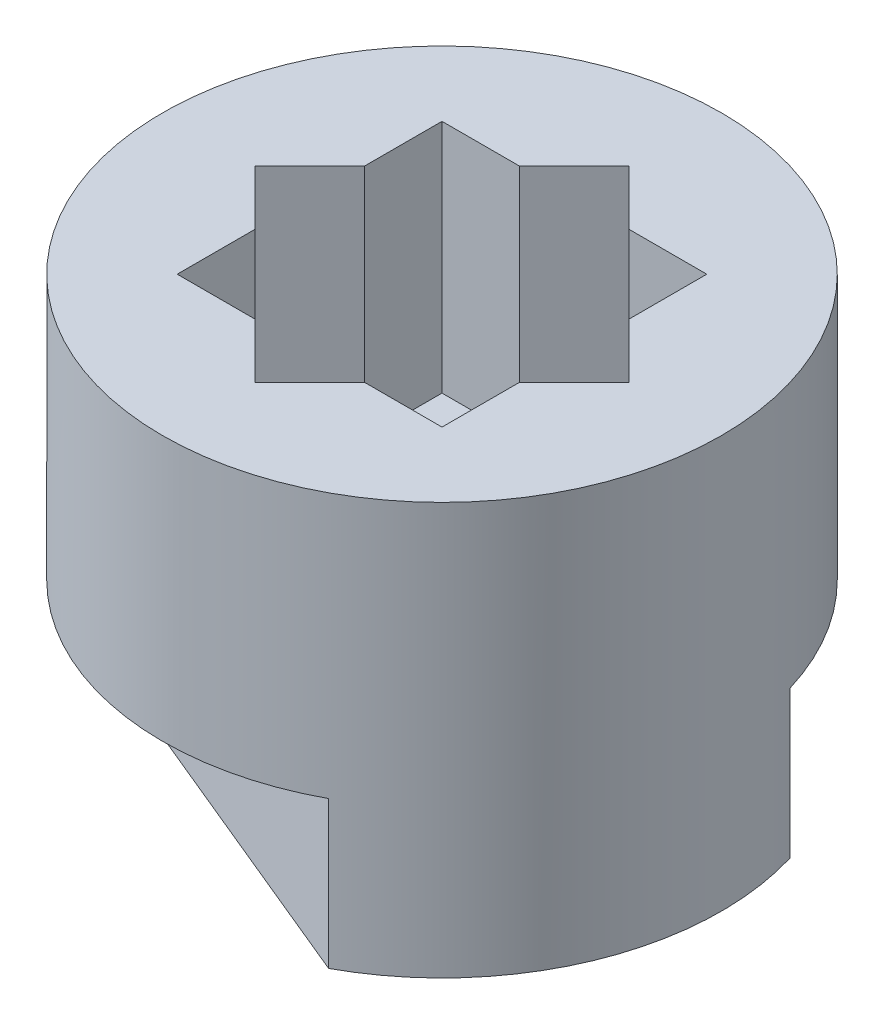
ISO-10303-21;
HEADER;
FILE_DESCRIPTION(('STEP AP214'),'2;1');
FILE_NAME('part.step','',(''),(''),'','','');
FILE_SCHEMA(('AUTOMOTIVE_DESIGN { 1 0 10303 214 1 1 1 1 }'));
ENDSEC;
DATA;
#1=APPLICATION_CONTEXT('core data for automotive mechanical design processes');
#2=APPLICATION_PROTOCOL_DEFINITION('international standard','automotive_design',2000,#1);
#3=PRODUCT_CONTEXT('',#1,'mechanical');
#4=PRODUCT('Part','Part','',(#3));
#5=PRODUCT_RELATED_PRODUCT_CATEGORY('part','',(#4));
#6=PRODUCT_DEFINITION_FORMATION('','',#4);
#7=PRODUCT_DEFINITION_CONTEXT('part definition',#1,'design');
#8=PRODUCT_DEFINITION('design','',#6,#7);
#9=PRODUCT_DEFINITION_SHAPE('','',#8);
#10=(LENGTH_UNIT() NAMED_UNIT(*) SI_UNIT(.MILLI.,.METRE.));
#11=(NAMED_UNIT(*) PLANE_ANGLE_UNIT() SI_UNIT($,.RADIAN.));
#12=(NAMED_UNIT(*) SI_UNIT($,.STERADIAN.) SOLID_ANGLE_UNIT());
#13=UNCERTAINTY_MEASURE_WITH_UNIT(LENGTH_MEASURE(1.E-05),#10,'distance_accuracy_value','');
#14=(GEOMETRIC_REPRESENTATION_CONTEXT(3) GLOBAL_UNCERTAINTY_ASSIGNED_CONTEXT((#13)) GLOBAL_UNIT_ASSIGNED_CONTEXT((#10,
#11,#12)) REPRESENTATION_CONTEXT('',''));
#15=CARTESIAN_POINT('',(0.,0.,0.));
#16=DIRECTION('',(0.,0.,1.));
#17=DIRECTION('',(1.,0.,0.));
#18=AXIS2_PLACEMENT_3D('',#15,#16,#17);
#19=CARTESIAN_POINT('',(0.,7.,0.));
#20=DIRECTION('',(0.,-1.,0.));
#21=DIRECTION('',(0.,0.,-1.));
#22=AXIS2_PLACEMENT_3D('',#19,#20,#21);
#23=CYLINDRICAL_SURFACE('',#22,4.75);
#24=CARTESIAN_POINT('',(0.,7.,0.));
#25=DIRECTION('',(0.,1.,0.));
#26=DIRECTION('',(0.,0.,1.));
#27=AXIS2_PLACEMENT_3D('',#24,#25,#26);
#28=CIRCLE('',#27,4.75);
#29=CARTESIAN_POINT('',(0.,7.,4.75));
#30=VERTEX_POINT('',#29);
#31=EDGE_CURVE('E12',#30,#30,#28,.T.);
#32=ORIENTED_EDGE('',*,*,#31,.F.);
#33=EDGE_LOOP('',(#32));
#34=FACE_BOUND('',#33,.T.);
#35=DIRECTION('',(0.,-1.,0.));
#36=VECTOR('',#35,1.);
#37=CARTESIAN_POINT('',(4.55044913613829,14.6014245367566,-1.36231885379977));
#38=LINE('',#37,#36);
#39=CARTESIAN_POINT('',(4.55044913613829,2.5,-1.36231885379977));
#40=VERTEX_POINT('',#39);
#41=CARTESIAN_POINT('',(4.55044913613829,0.,-1.36231885379977));
#42=VERTEX_POINT('',#41);
#43=EDGE_CURVE('E48',#40,#42,#38,.T.);
#44=ORIENTED_EDGE('',*,*,#43,.F.);
#45=CARTESIAN_POINT('',(0.,2.5,0.));
#46=DIRECTION('',(0.,1.,0.));
#47=DIRECTION('',(0.,0.,1.));
#48=AXIS2_PLACEMENT_3D('',#45,#46,#47);
#49=CIRCLE('',#48,4.75);
#50=CARTESIAN_POINT('',(-2.25434854194775,2.5,-4.18095834126795));
#51=VERTEX_POINT('',#50);
#52=EDGE_CURVE('E176',#51,#40,#49,.F.);
#53=ORIENTED_EDGE('',*,*,#52,.F.);
#54=DIRECTION('',(0.,-1.,0.));
#55=VECTOR('',#54,1.);
#56=CARTESIAN_POINT('',(-2.25434854194775,14.6014245367566,-4.18095834126795));
#57=LINE('',#56,#55);
#58=CARTESIAN_POINT('',(-2.25434854194775,0.,-4.18095834126795));
#59=VERTEX_POINT('',#58);
#60=EDGE_CURVE('E173',#51,#59,#57,.T.);
#61=ORIENTED_EDGE('',*,*,#60,.T.);
#62=CARTESIAN_POINT('',(0.,0.,0.));
#63=DIRECTION('',(0.,1.,0.));
#64=DIRECTION('',(0.,0.,1.));
#65=AXIS2_PLACEMENT_3D('',#62,#63,#64);
#66=CIRCLE('',#65,4.75);
#67=CARTESIAN_POINT('',(-4.55044913613829,0.,1.36231885379977));
#68=VERTEX_POINT('',#67);
#69=EDGE_CURVE('E56',#59,#68,#66,.T.);
#70=ORIENTED_EDGE('',*,*,#69,.T.);
#71=DIRECTION('',(0.,-1.,0.));
#72=VECTOR('',#71,1.);
#73=CARTESIAN_POINT('',(-4.55044913613829,14.6014245367566,1.36231885379977));
#74=LINE('',#73,#72);
#75=CARTESIAN_POINT('',(-4.55044913613829,2.5,1.36231885379977));
#76=VERTEX_POINT('',#75);
#77=EDGE_CURVE('E196',#76,#68,#74,.T.);
#78=ORIENTED_EDGE('',*,*,#77,.F.);
#79=CARTESIAN_POINT('',(0.,2.5,0.));
#80=DIRECTION('',(0.,1.,0.));
#81=DIRECTION('',(0.,0.,1.));
#82=AXIS2_PLACEMENT_3D('',#79,#80,#81);
#83=CIRCLE('',#82,4.75);
#84=CARTESIAN_POINT('',(2.25434854194775,2.5,4.18095834126795));
#85=VERTEX_POINT('',#84);
#86=EDGE_CURVE('E193',#85,#76,#83,.F.);
#87=ORIENTED_EDGE('',*,*,#86,.F.);
#88=DIRECTION('',(0.,-1.,0.));
#89=VECTOR('',#88,1.);
#90=CARTESIAN_POINT('',(2.25434854194775,14.6014245367566,4.18095834126795));
#91=LINE('',#90,#89);
#92=CARTESIAN_POINT('',(2.25434854194775,0.,4.18095834126795));
#93=VERTEX_POINT('',#92);
#94=EDGE_CURVE('E192',#85,#93,#91,.T.);
#95=ORIENTED_EDGE('',*,*,#94,.T.);
#96=EDGE_CURVE('E40',#93,#42,#66,.T.);
#97=ORIENTED_EDGE('',*,*,#96,.T.);
#98=EDGE_LOOP('',(#44,#53,#61,#70,#78,#87,#95,#97));
#99=FACE_BOUND('',#98,.T.);
#100=ADVANCED_FACE('F32',(#34,#99),#23,.T.);
#101=CARTESIAN_POINT('',(0.,0.,0.));
#102=DIRECTION('',(0.,1.,0.));
#103=DIRECTION('',(0.,0.,1.));
#104=AXIS2_PLACEMENT_3D('',#101,#102,#103);
#105=PLANE('',#104);
#106=CARTESIAN_POINT('',(0.,0.,0.));
#107=DIRECTION('',(0.,-1.,0.));
#108=DIRECTION('',(0.,0.,-1.));
#109=AXIS2_PLACEMENT_3D('',#106,#107,#108);
#110=CIRCLE('',#109,1.85);
#111=CARTESIAN_POINT('',(0.,0.,-1.85));
#112=VERTEX_POINT('',#111);
#113=EDGE_CURVE('E199',#112,#112,#110,.T.);
#114=ORIENTED_EDGE('',*,*,#113,.F.);
#115=EDGE_LOOP('',(#114));
#116=FACE_BOUND('',#115,.T.);
#117=DIRECTION('',(0.923879532511287,0.,0.382683432365089));
#118=VECTOR('',#117,1.);
#119=CARTESIAN_POINT('',(-2.59658263460444,0.,-4.3227163439528));
#120=LINE('',#119,#118);
#121=EDGE_CURVE('E184',#59,#42,#120,.T.);
#122=ORIENTED_EDGE('',*,*,#121,.T.);
#123=ORIENTED_EDGE('',*,*,#96,.F.);
#124=DIRECTION('',(0.923879532511287,0.,0.382683432365089));
#125=VECTOR('',#124,1.);
#126=CARTESIAN_POINT('',(-4.89268322879497,0.,1.22056085111492));
#127=LINE('',#126,#125);
#128=EDGE_CURVE('E187',#68,#93,#127,.T.);
#129=ORIENTED_EDGE('',*,*,#128,.F.);
#130=ORIENTED_EDGE('',*,*,#69,.F.);
#131=EDGE_LOOP('',(#122,#123,#129,#130));
#132=FACE_BOUND('',#131,.T.);
#133=ADVANCED_FACE('F407',(#116,#132),#105,.F.);
#134=CARTESIAN_POINT('',(0.,7.,0.));
#135=DIRECTION('',(0.,1.,0.));
#136=DIRECTION('',(0.,0.,1.));
#137=AXIS2_PLACEMENT_3D('',#134,#135,#136);
#138=PLANE('',#137);
#139=DIRECTION('',(0.707106781186547,0.,-0.707106781186548));
#140=VECTOR('',#139,1.);
#141=CARTESIAN_POINT('',(2.25,7.,0.931980515339465));
#142=LINE('',#141,#140);
#143=CARTESIAN_POINT('',(2.25,7.,0.931980515339465));
#144=VERTEX_POINT('',#143);
#145=CARTESIAN_POINT('',(3.18198051533946,7.,0.));
#146=VERTEX_POINT('',#145);
#147=EDGE_CURVE('E252',#144,#146,#142,.T.);
#148=ORIENTED_EDGE('',*,*,#147,.F.);
#149=DIRECTION('',(0.,0.,-1.));
#150=VECTOR('',#149,1.);
#151=CARTESIAN_POINT('',(2.25,7.,2.25));
#152=LINE('',#151,#150);
#153=CARTESIAN_POINT('',(2.25,7.,2.25));
#154=VERTEX_POINT('',#153);
#155=EDGE_CURVE('E206',#154,#144,#152,.T.);
#156=ORIENTED_EDGE('',*,*,#155,.F.);
#157=DIRECTION('',(1.,0.,0.));
#158=VECTOR('',#157,1.);
#159=CARTESIAN_POINT('',(0.931980515339463,7.,2.25));
#160=LINE('',#159,#158);
#161=CARTESIAN_POINT('',(0.931980515339463,7.,2.25));
#162=VERTEX_POINT('',#161);
#163=EDGE_CURVE('E293',#162,#154,#160,.T.);
#164=ORIENTED_EDGE('',*,*,#163,.F.);
#165=DIRECTION('',(0.707106781186548,0.,-0.707106781186547));
#166=VECTOR('',#165,1.);
#167=CARTESIAN_POINT('',(0.,7.,3.18198051533946));
#168=LINE('',#167,#166);
#169=CARTESIAN_POINT('',(0.,7.,3.18198051533946));
#170=VERTEX_POINT('',#169);
#171=EDGE_CURVE('E290',#170,#162,#168,.T.);
#172=ORIENTED_EDGE('',*,*,#171,.F.);
#173=DIRECTION('',(0.707106781186548,0.,0.707106781186548));
#174=VECTOR('',#173,1.);
#175=CARTESIAN_POINT('',(-0.931980515339464,7.,2.25));
#176=LINE('',#175,#174);
#177=CARTESIAN_POINT('',(-0.931980515339464,7.,2.25));
#178=VERTEX_POINT('',#177);
#179=EDGE_CURVE('E287',#178,#170,#176,.T.);
#180=ORIENTED_EDGE('',*,*,#179,.F.);
#181=DIRECTION('',(1.,0.,0.));
#182=VECTOR('',#181,1.);
#183=CARTESIAN_POINT('',(-2.25,7.,2.25));
#184=LINE('',#183,#182);
#185=CARTESIAN_POINT('',(-2.25,7.,2.25));
#186=VERTEX_POINT('',#185);
#187=EDGE_CURVE('E284',#186,#178,#184,.T.);
#188=ORIENTED_EDGE('',*,*,#187,.F.);
#189=DIRECTION('',(0.,0.,1.));
#190=VECTOR('',#189,1.);
#191=CARTESIAN_POINT('',(-2.25,7.,2.25));
#192=LINE('',#191,#190);
#193=CARTESIAN_POINT('',(-2.25,7.,0.931980515339465));
#194=VERTEX_POINT('',#193);
#195=EDGE_CURVE('E281',#194,#186,#192,.T.);
#196=ORIENTED_EDGE('',*,*,#195,.F.);
#197=DIRECTION('',(0.707106781186548,0.,0.707106781186547));
#198=VECTOR('',#197,1.);
#199=CARTESIAN_POINT('',(-3.18198051533947,7.,0.));
#200=LINE('',#199,#198);
#201=CARTESIAN_POINT('',(-3.18198051533947,7.,0.));
#202=VERTEX_POINT('',#201);
#203=EDGE_CURVE('E278',#202,#194,#200,.T.);
#204=ORIENTED_EDGE('',*,*,#203,.F.);
#205=DIRECTION('',(-0.707106781186548,0.,0.707106781186547));
#206=VECTOR('',#205,1.);
#207=CARTESIAN_POINT('',(-3.18198051533947,7.,0.));
#208=LINE('',#207,#206);
#209=CARTESIAN_POINT('',(-2.25,7.,-0.931980515339465));
#210=VERTEX_POINT('',#209);
#211=EDGE_CURVE('E275',#210,#202,#208,.T.);
#212=ORIENTED_EDGE('',*,*,#211,.F.);
#213=DIRECTION('',(0.,0.,1.));
#214=VECTOR('',#213,1.);
#215=CARTESIAN_POINT('',(-2.25,7.,-0.931980515339465));
#216=LINE('',#215,#214);
#217=CARTESIAN_POINT('',(-2.25,7.,-2.25));
#218=VERTEX_POINT('',#217);
#219=EDGE_CURVE('E272',#218,#210,#216,.T.);
#220=ORIENTED_EDGE('',*,*,#219,.F.);
#221=DIRECTION('',(-1.,0.,0.));
#222=VECTOR('',#221,1.);
#223=CARTESIAN_POINT('',(-2.25,7.,-2.25));
#224=LINE('',#223,#222);
#225=CARTESIAN_POINT('',(-0.931980515339465,7.,-2.25));
#226=VERTEX_POINT('',#225);
#227=EDGE_CURVE('E269',#226,#218,#224,.T.);
#228=ORIENTED_EDGE('',*,*,#227,.F.);
#229=DIRECTION('',(-0.707106781186547,0.,0.707106781186548));
#230=VECTOR('',#229,1.);
#231=CARTESIAN_POINT('',(-0.931980515339465,7.,-2.25));
#232=LINE('',#231,#230);
#233=CARTESIAN_POINT('',(0.,7.,-3.18198051533946));
#234=VERTEX_POINT('',#233);
#235=EDGE_CURVE('E266',#234,#226,#232,.T.);
#236=ORIENTED_EDGE('',*,*,#235,.F.);
#237=DIRECTION('',(-0.707106781186548,0.,-0.707106781186547));
#238=VECTOR('',#237,1.);
#239=CARTESIAN_POINT('',(0.,7.,-3.18198051533946));
#240=LINE('',#239,#238);
#241=CARTESIAN_POINT('',(0.931980515339464,7.,-2.25));
#242=VERTEX_POINT('',#241);
#243=EDGE_CURVE('E263',#242,#234,#240,.T.);
#244=ORIENTED_EDGE('',*,*,#243,.F.);
#245=DIRECTION('',(-1.,0.,0.));
#246=VECTOR('',#245,1.);
#247=CARTESIAN_POINT('',(0.931980515339464,7.,-2.25));
#248=LINE('',#247,#246);
#249=CARTESIAN_POINT('',(2.25,7.,-2.25));
#250=VERTEX_POINT('',#249);
#251=EDGE_CURVE('E260',#250,#242,#248,.T.);
#252=ORIENTED_EDGE('',*,*,#251,.F.);
#253=DIRECTION('',(0.,0.,-1.));
#254=VECTOR('',#253,1.);
#255=CARTESIAN_POINT('',(2.25,7.,-0.931980515339465));
#256=LINE('',#255,#254);
#257=CARTESIAN_POINT('',(2.25,7.,-0.931980515339465));
#258=VERTEX_POINT('',#257);
#259=EDGE_CURVE('E257',#258,#250,#256,.T.);
#260=ORIENTED_EDGE('',*,*,#259,.F.);
#261=DIRECTION('',(-0.707106781186547,0.,-0.707106781186548));
#262=VECTOR('',#261,1.);
#263=CARTESIAN_POINT('',(2.25,7.,-0.931980515339465));
#264=LINE('',#263,#262);
#265=EDGE_CURVE('E254',#146,#258,#264,.T.);
#266=ORIENTED_EDGE('',*,*,#265,.F.);
#267=EDGE_LOOP('',(#148,#156,#164,#172,#180,#188,#196,#204,#212,#220,#228,#236,#244,#252,#260,#266));
#268=FACE_BOUND('',#267,.T.);
#269=ORIENTED_EDGE('',*,*,#31,.T.);
#270=EDGE_LOOP('',(#269));
#271=FACE_BOUND('',#270,.T.);
#272=ADVANCED_FACE('F338',(#268,#271),#138,.T.);
#273=CARTESIAN_POINT('',(2.25,3.,0.931980515339465));
#274=DIRECTION('',(0.707106781186548,0.,0.707106781186547));
#275=DIRECTION('',(0.707106781186547,0.,-0.707106781186548));
#276=AXIS2_PLACEMENT_3D('',#273,#274,#275);
#277=PLANE('',#276);
#278=ORIENTED_EDGE('',*,*,#147,.T.);
#279=DIRECTION('',(0.,1.,0.));
#280=VECTOR('',#279,1.);
#281=CARTESIAN_POINT('',(3.18198051533946,3.,0.));
#282=LINE('',#281,#280);
#283=CARTESIAN_POINT('',(3.18198051533946,3.,0.));
#284=VERTEX_POINT('',#283);
#285=EDGE_CURVE('E251',#284,#146,#282,.T.);
#286=ORIENTED_EDGE('',*,*,#285,.F.);
#287=DIRECTION('',(0.707106781186547,0.,-0.707106781186548));
#288=VECTOR('',#287,1.);
#289=CARTESIAN_POINT('',(2.25,3.,0.931980515339465));
#290=LINE('',#289,#288);
#291=CARTESIAN_POINT('',(2.25,3.,0.931980515339465));
#292=VERTEX_POINT('',#291);
#293=EDGE_CURVE('E202',#292,#284,#290,.T.);
#294=ORIENTED_EDGE('',*,*,#293,.F.);
#295=DIRECTION('',(0.,1.,0.));
#296=VECTOR('',#295,1.);
#297=CARTESIAN_POINT('',(2.25,3.,0.931980515339465));
#298=LINE('',#297,#296);
#299=EDGE_CURVE('E298',#292,#144,#298,.T.);
#300=ORIENTED_EDGE('',*,*,#299,.T.);
#301=EDGE_LOOP('',(#278,#286,#294,#300));
#302=FACE_BOUND('',#301,.T.);
#303=ADVANCED_FACE('F350',(#302),#277,.F.);
#304=CARTESIAN_POINT('',(2.25,3.,2.25));
#305=DIRECTION('',(1.,0.,0.));
#306=DIRECTION('',(0.,0.,-1.));
#307=AXIS2_PLACEMENT_3D('',#304,#305,#306);
#308=PLANE('',#307);
#309=ORIENTED_EDGE('',*,*,#155,.T.);
#310=ORIENTED_EDGE('',*,*,#299,.F.);
#311=DIRECTION('',(0.,0.,-1.));
#312=VECTOR('',#311,1.);
#313=CARTESIAN_POINT('',(2.25,3.,2.25));
#314=LINE('',#313,#312);
#315=CARTESIAN_POINT('',(2.25,3.,2.25));
#316=VERTEX_POINT('',#315);
#317=EDGE_CURVE('E248',#316,#292,#314,.T.);
#318=ORIENTED_EDGE('',*,*,#317,.F.);
#319=DIRECTION('',(0.,1.,0.));
#320=VECTOR('',#319,1.);
#321=CARTESIAN_POINT('',(2.25,3.,2.25));
#322=LINE('',#321,#320);
#323=EDGE_CURVE('E300',#316,#154,#322,.T.);
#324=ORIENTED_EDGE('',*,*,#323,.T.);
#325=EDGE_LOOP('',(#309,#310,#318,#324));
#326=FACE_BOUND('',#325,.T.);
#327=ADVANCED_FACE('F352',(#326),#308,.F.);
#328=CARTESIAN_POINT('',(0.931980515339463,3.,2.25));
#329=DIRECTION('',(0.,0.,1.));
#330=DIRECTION('',(1.,0.,0.));
#331=AXIS2_PLACEMENT_3D('',#328,#329,#330);
#332=PLANE('',#331);
#333=ORIENTED_EDGE('',*,*,#163,.T.);
#334=ORIENTED_EDGE('',*,*,#323,.F.);
#335=DIRECTION('',(1.,0.,0.));
#336=VECTOR('',#335,1.);
#337=CARTESIAN_POINT('',(0.931980515339463,3.,2.25));
#338=LINE('',#337,#336);
#339=CARTESIAN_POINT('',(0.931980515339463,3.,2.25));
#340=VERTEX_POINT('',#339);
#341=EDGE_CURVE('E245',#340,#316,#338,.T.);
#342=ORIENTED_EDGE('',*,*,#341,.F.);
#343=DIRECTION('',(0.,1.,0.));
#344=VECTOR('',#343,1.);
#345=CARTESIAN_POINT('',(0.931980515339463,3.,2.25));
#346=LINE('',#345,#344);
#347=EDGE_CURVE('E302',#340,#162,#346,.T.);
#348=ORIENTED_EDGE('',*,*,#347,.T.);
#349=EDGE_LOOP('',(#333,#334,#342,#348));
#350=FACE_BOUND('',#349,.T.);
#351=ADVANCED_FACE('F357',(#350),#332,.F.);
#352=CARTESIAN_POINT('',(0.,3.,3.18198051533946));
#353=DIRECTION('',(0.707106781186547,0.,0.707106781186548));
#354=DIRECTION('',(0.707106781186548,0.,-0.707106781186547));
#355=AXIS2_PLACEMENT_3D('',#352,#353,#354);
#356=PLANE('',#355);
#357=ORIENTED_EDGE('',*,*,#171,.T.);
#358=ORIENTED_EDGE('',*,*,#347,.F.);
#359=DIRECTION('',(0.707106781186548,0.,-0.707106781186547));
#360=VECTOR('',#359,1.);
#361=CARTESIAN_POINT('',(0.,3.,3.18198051533946));
#362=LINE('',#361,#360);
#363=CARTESIAN_POINT('',(0.,3.,3.18198051533946));
#364=VERTEX_POINT('',#363);
#365=EDGE_CURVE('E242',#364,#340,#362,.T.);
#366=ORIENTED_EDGE('',*,*,#365,.F.);
#367=DIRECTION('',(0.,1.,0.));
#368=VECTOR('',#367,1.);
#369=CARTESIAN_POINT('',(0.,3.,3.18198051533946));
#370=LINE('',#369,#368);
#371=EDGE_CURVE('E304',#364,#170,#370,.T.);
#372=ORIENTED_EDGE('',*,*,#371,.T.);
#373=EDGE_LOOP('',(#357,#358,#366,#372));
#374=FACE_BOUND('',#373,.T.);
#375=ADVANCED_FACE('F361',(#374),#356,.F.);
#376=CARTESIAN_POINT('',(-0.931980515339464,3.,2.25));
#377=DIRECTION('',(-0.707106781186547,0.,0.707106781186547));
#378=DIRECTION('',(0.707106781186548,0.,0.707106781186548));
#379=AXIS2_PLACEMENT_3D('',#376,#377,#378);
#380=PLANE('',#379);
#381=ORIENTED_EDGE('',*,*,#179,.T.);
#382=ORIENTED_EDGE('',*,*,#371,.F.);
#383=DIRECTION('',(0.707106781186548,0.,0.707106781186548));
#384=VECTOR('',#383,1.);
#385=CARTESIAN_POINT('',(-0.931980515339464,3.,2.25));
#386=LINE('',#385,#384);
#387=CARTESIAN_POINT('',(-0.931980515339464,3.,2.25));
#388=VERTEX_POINT('',#387);
#389=EDGE_CURVE('E239',#388,#364,#386,.T.);
#390=ORIENTED_EDGE('',*,*,#389,.F.);
#391=DIRECTION('',(0.,1.,0.));
#392=VECTOR('',#391,1.);
#393=CARTESIAN_POINT('',(-0.931980515339464,3.,2.25));
#394=LINE('',#393,#392);
#395=EDGE_CURVE('E306',#388,#178,#394,.T.);
#396=ORIENTED_EDGE('',*,*,#395,.T.);
#397=EDGE_LOOP('',(#381,#382,#390,#396));
#398=FACE_BOUND('',#397,.T.);
#399=ADVANCED_FACE('F364',(#398),#380,.F.);
#400=CARTESIAN_POINT('',(-2.25,3.,2.25));
#401=DIRECTION('',(0.,0.,1.));
#402=DIRECTION('',(1.,0.,0.));
#403=AXIS2_PLACEMENT_3D('',#400,#401,#402);
#404=PLANE('',#403);
#405=ORIENTED_EDGE('',*,*,#187,.T.);
#406=ORIENTED_EDGE('',*,*,#395,.F.);
#407=DIRECTION('',(1.,0.,0.));
#408=VECTOR('',#407,1.);
#409=CARTESIAN_POINT('',(-2.25,3.,2.25));
#410=LINE('',#409,#408);
#411=CARTESIAN_POINT('',(-2.25,3.,2.25));
#412=VERTEX_POINT('',#411);
#413=EDGE_CURVE('E236',#412,#388,#410,.T.);
#414=ORIENTED_EDGE('',*,*,#413,.F.);
#415=DIRECTION('',(0.,1.,0.));
#416=VECTOR('',#415,1.);
#417=CARTESIAN_POINT('',(-2.25,3.,2.25));
#418=LINE('',#417,#416);
#419=EDGE_CURVE('E308',#412,#186,#418,.T.);
#420=ORIENTED_EDGE('',*,*,#419,.T.);
#421=EDGE_LOOP('',(#405,#406,#414,#420));
#422=FACE_BOUND('',#421,.T.);
#423=ADVANCED_FACE('F369',(#422),#404,.F.);
#424=CARTESIAN_POINT('',(-2.25,3.,2.25));
#425=DIRECTION('',(-1.,0.,0.));
#426=DIRECTION('',(0.,0.,1.));
#427=AXIS2_PLACEMENT_3D('',#424,#425,#426);
#428=PLANE('',#427);
#429=ORIENTED_EDGE('',*,*,#195,.T.);
#430=ORIENTED_EDGE('',*,*,#419,.F.);
#431=DIRECTION('',(0.,0.,1.));
#432=VECTOR('',#431,1.);
#433=CARTESIAN_POINT('',(-2.25,3.,2.25));
#434=LINE('',#433,#432);
#435=CARTESIAN_POINT('',(-2.25,3.,0.931980515339465));
#436=VERTEX_POINT('',#435);
#437=EDGE_CURVE('E233',#436,#412,#434,.T.);
#438=ORIENTED_EDGE('',*,*,#437,.F.);
#439=DIRECTION('',(0.,1.,0.));
#440=VECTOR('',#439,1.);
#441=CARTESIAN_POINT('',(-2.25,3.,0.931980515339465));
#442=LINE('',#441,#440);
#443=EDGE_CURVE('E310',#436,#194,#442,.T.);
#444=ORIENTED_EDGE('',*,*,#443,.T.);
#445=EDGE_LOOP('',(#429,#430,#438,#444));
#446=FACE_BOUND('',#445,.T.);
#447=ADVANCED_FACE('F373',(#446),#428,.F.);
#448=CARTESIAN_POINT('',(-3.18198051533947,3.,0.));
#449=DIRECTION('',(-0.707106781186547,0.,0.707106781186548));
#450=DIRECTION('',(0.707106781186548,0.,0.707106781186547));
#451=AXIS2_PLACEMENT_3D('',#448,#449,#450);
#452=PLANE('',#451);
#453=ORIENTED_EDGE('',*,*,#203,.T.);
#454=ORIENTED_EDGE('',*,*,#443,.F.);
#455=DIRECTION('',(0.707106781186548,0.,0.707106781186547));
#456=VECTOR('',#455,1.);
#457=CARTESIAN_POINT('',(-3.18198051533947,3.,0.));
#458=LINE('',#457,#456);
#459=CARTESIAN_POINT('',(-3.18198051533947,3.,0.));
#460=VERTEX_POINT('',#459);
#461=EDGE_CURVE('E230',#460,#436,#458,.T.);
#462=ORIENTED_EDGE('',*,*,#461,.F.);
#463=DIRECTION('',(0.,1.,0.));
#464=VECTOR('',#463,1.);
#465=CARTESIAN_POINT('',(-3.18198051533947,3.,0.));
#466=LINE('',#465,#464);
#467=EDGE_CURVE('E312',#460,#202,#466,.T.);
#468=ORIENTED_EDGE('',*,*,#467,.T.);
#469=EDGE_LOOP('',(#453,#454,#462,#468));
#470=FACE_BOUND('',#469,.T.);
#471=ADVANCED_FACE('F376',(#470),#452,.F.);
#472=CARTESIAN_POINT('',(-3.18198051533947,3.,0.));
#473=DIRECTION('',(-0.707106781186547,0.,-0.707106781186548));
#474=DIRECTION('',(-0.707106781186548,0.,0.707106781186547));
#475=AXIS2_PLACEMENT_3D('',#472,#473,#474);
#476=PLANE('',#475);
#477=ORIENTED_EDGE('',*,*,#211,.T.);
#478=ORIENTED_EDGE('',*,*,#467,.F.);
#479=DIRECTION('',(-0.707106781186548,0.,0.707106781186547));
#480=VECTOR('',#479,1.);
#481=CARTESIAN_POINT('',(-3.18198051533947,3.,0.));
#482=LINE('',#481,#480);
#483=CARTESIAN_POINT('',(-2.25,3.,-0.931980515339465));
#484=VERTEX_POINT('',#483);
#485=EDGE_CURVE('E227',#484,#460,#482,.T.);
#486=ORIENTED_EDGE('',*,*,#485,.F.);
#487=DIRECTION('',(0.,1.,0.));
#488=VECTOR('',#487,1.);
#489=CARTESIAN_POINT('',(-2.25,3.,-0.931980515339465));
#490=LINE('',#489,#488);
#491=EDGE_CURVE('E314',#484,#210,#490,.T.);
#492=ORIENTED_EDGE('',*,*,#491,.T.);
#493=EDGE_LOOP('',(#477,#478,#486,#492));
#494=FACE_BOUND('',#493,.T.);
#495=ADVANCED_FACE('F381',(#494),#476,.F.);
#496=CARTESIAN_POINT('',(-2.25,3.,-0.931980515339465));
#497=DIRECTION('',(-1.,0.,0.));
#498=DIRECTION('',(0.,0.,1.));
#499=AXIS2_PLACEMENT_3D('',#496,#497,#498);
#500=PLANE('',#499);
#501=ORIENTED_EDGE('',*,*,#219,.T.);
#502=ORIENTED_EDGE('',*,*,#491,.F.);
#503=DIRECTION('',(0.,0.,1.));
#504=VECTOR('',#503,1.);
#505=CARTESIAN_POINT('',(-2.25,3.,-0.931980515339465));
#506=LINE('',#505,#504);
#507=CARTESIAN_POINT('',(-2.25,3.,-2.25));
#508=VERTEX_POINT('',#507);
#509=EDGE_CURVE('E224',#508,#484,#506,.T.);
#510=ORIENTED_EDGE('',*,*,#509,.F.);
#511=DIRECTION('',(0.,1.,0.));
#512=VECTOR('',#511,1.);
#513=CARTESIAN_POINT('',(-2.25,3.,-2.25));
#514=LINE('',#513,#512);
#515=EDGE_CURVE('E316',#508,#218,#514,.T.);
#516=ORIENTED_EDGE('',*,*,#515,.T.);
#517=EDGE_LOOP('',(#501,#502,#510,#516));
#518=FACE_BOUND('',#517,.T.);
#519=ADVANCED_FACE('F385',(#518),#500,.F.);
#520=CARTESIAN_POINT('',(-2.25,3.,-2.25));
#521=DIRECTION('',(0.,0.,-1.));
#522=DIRECTION('',(-1.,0.,0.));
#523=AXIS2_PLACEMENT_3D('',#520,#521,#522);
#524=PLANE('',#523);
#525=ORIENTED_EDGE('',*,*,#227,.T.);
#526=ORIENTED_EDGE('',*,*,#515,.F.);
#527=DIRECTION('',(-1.,0.,0.));
#528=VECTOR('',#527,1.);
#529=CARTESIAN_POINT('',(-2.25,3.,-2.25));
#530=LINE('',#529,#528);
#531=CARTESIAN_POINT('',(-0.931980515339465,3.,-2.25));
#532=VERTEX_POINT('',#531);
#533=EDGE_CURVE('E221',#532,#508,#530,.T.);
#534=ORIENTED_EDGE('',*,*,#533,.F.);
#535=DIRECTION('',(0.,1.,0.));
#536=VECTOR('',#535,1.);
#537=CARTESIAN_POINT('',(-0.931980515339465,3.,-2.25));
#538=LINE('',#537,#536);
#539=EDGE_CURVE('E318',#532,#226,#538,.T.);
#540=ORIENTED_EDGE('',*,*,#539,.T.);
#541=EDGE_LOOP('',(#525,#526,#534,#540));
#542=FACE_BOUND('',#541,.T.);
#543=ADVANCED_FACE('F388',(#542),#524,.F.);
#544=CARTESIAN_POINT('',(-0.931980515339465,3.,-2.25));
#545=DIRECTION('',(-0.707106781186548,0.,-0.707106781186547));
#546=DIRECTION('',(-0.707106781186547,0.,0.707106781186548));
#547=AXIS2_PLACEMENT_3D('',#544,#545,#546);
#548=PLANE('',#547);
#549=ORIENTED_EDGE('',*,*,#235,.T.);
#550=ORIENTED_EDGE('',*,*,#539,.F.);
#551=DIRECTION('',(-0.707106781186547,0.,0.707106781186548));
#552=VECTOR('',#551,1.);
#553=CARTESIAN_POINT('',(-0.931980515339465,3.,-2.25));
#554=LINE('',#553,#552);
#555=CARTESIAN_POINT('',(0.,3.,-3.18198051533946));
#556=VERTEX_POINT('',#555);
#557=EDGE_CURVE('E218',#556,#532,#554,.T.);
#558=ORIENTED_EDGE('',*,*,#557,.F.);
#559=DIRECTION('',(0.,1.,0.));
#560=VECTOR('',#559,1.);
#561=CARTESIAN_POINT('',(0.,3.,-3.18198051533946));
#562=LINE('',#561,#560);
#563=EDGE_CURVE('E320',#556,#234,#562,.T.);
#564=ORIENTED_EDGE('',*,*,#563,.T.);
#565=EDGE_LOOP('',(#549,#550,#558,#564));
#566=FACE_BOUND('',#565,.T.);
#567=ADVANCED_FACE('F391',(#566),#548,.F.);
#568=CARTESIAN_POINT('',(0.,3.,-3.18198051533946));
#569=DIRECTION('',(0.707106781186547,0.,-0.707106781186548));
#570=DIRECTION('',(-0.707106781186548,0.,-0.707106781186547));
#571=AXIS2_PLACEMENT_3D('',#568,#569,#570);
#572=PLANE('',#571);
#573=ORIENTED_EDGE('',*,*,#243,.T.);
#574=ORIENTED_EDGE('',*,*,#563,.F.);
#575=DIRECTION('',(-0.707106781186548,0.,-0.707106781186547));
#576=VECTOR('',#575,1.);
#577=CARTESIAN_POINT('',(0.,3.,-3.18198051533946));
#578=LINE('',#577,#576);
#579=CARTESIAN_POINT('',(0.931980515339464,3.,-2.25));
#580=VERTEX_POINT('',#579);
#581=EDGE_CURVE('E215',#580,#556,#578,.T.);
#582=ORIENTED_EDGE('',*,*,#581,.F.);
#583=DIRECTION('',(0.,1.,0.));
#584=VECTOR('',#583,1.);
#585=CARTESIAN_POINT('',(0.931980515339464,3.,-2.25));
#586=LINE('',#585,#584);
#587=EDGE_CURVE('E322',#580,#242,#586,.T.);
#588=ORIENTED_EDGE('',*,*,#587,.T.);
#589=EDGE_LOOP('',(#573,#574,#582,#588));
#590=FACE_BOUND('',#589,.T.);
#591=ADVANCED_FACE('F395',(#590),#572,.F.);
#592=CARTESIAN_POINT('',(0.931980515339464,3.,-2.25));
#593=DIRECTION('',(0.,0.,-1.));
#594=DIRECTION('',(-1.,0.,0.));
#595=AXIS2_PLACEMENT_3D('',#592,#593,#594);
#596=PLANE('',#595);
#597=ORIENTED_EDGE('',*,*,#251,.T.);
#598=ORIENTED_EDGE('',*,*,#587,.F.);
#599=DIRECTION('',(-1.,0.,0.));
#600=VECTOR('',#599,1.);
#601=CARTESIAN_POINT('',(0.931980515339464,3.,-2.25));
#602=LINE('',#601,#600);
#603=CARTESIAN_POINT('',(2.25,3.,-2.25));
#604=VERTEX_POINT('',#603);
#605=EDGE_CURVE('E212',#604,#580,#602,.T.);
#606=ORIENTED_EDGE('',*,*,#605,.F.);
#607=DIRECTION('',(0.,1.,0.));
#608=VECTOR('',#607,1.);
#609=CARTESIAN_POINT('',(2.25,3.,-2.25));
#610=LINE('',#609,#608);
#611=EDGE_CURVE('E324',#604,#250,#610,.T.);
#612=ORIENTED_EDGE('',*,*,#611,.T.);
#613=EDGE_LOOP('',(#597,#598,#606,#612));
#614=FACE_BOUND('',#613,.T.);
#615=ADVANCED_FACE('F397',(#614),#596,.F.);
#616=CARTESIAN_POINT('',(2.25,3.,-0.931980515339465));
#617=DIRECTION('',(1.,0.,0.));
#618=DIRECTION('',(0.,0.,-1.));
#619=AXIS2_PLACEMENT_3D('',#616,#617,#618);
#620=PLANE('',#619);
#621=ORIENTED_EDGE('',*,*,#259,.T.);
#622=ORIENTED_EDGE('',*,*,#611,.F.);
#623=DIRECTION('',(0.,0.,-1.));
#624=VECTOR('',#623,1.);
#625=CARTESIAN_POINT('',(2.25,3.,-0.931980515339465));
#626=LINE('',#625,#624);
#627=CARTESIAN_POINT('',(2.25,3.,-0.931980515339465));
#628=VERTEX_POINT('',#627);
#629=EDGE_CURVE('E209',#628,#604,#626,.T.);
#630=ORIENTED_EDGE('',*,*,#629,.F.);
#631=DIRECTION('',(0.,1.,0.));
#632=VECTOR('',#631,1.);
#633=CARTESIAN_POINT('',(2.25,3.,-0.931980515339465));
#634=LINE('',#633,#632);
#635=EDGE_CURVE('E326',#628,#258,#634,.T.);
#636=ORIENTED_EDGE('',*,*,#635,.T.);
#637=EDGE_LOOP('',(#621,#622,#630,#636));
#638=FACE_BOUND('',#637,.T.);
#639=ADVANCED_FACE('F344',(#638),#620,.F.);
#640=CARTESIAN_POINT('',(2.25,3.,-0.931980515339465));
#641=DIRECTION('',(0.707106781186548,0.,-0.707106781186547));
#642=DIRECTION('',(-0.707106781186547,0.,-0.707106781186548));
#643=AXIS2_PLACEMENT_3D('',#640,#641,#642);
#644=PLANE('',#643);
#645=ORIENTED_EDGE('',*,*,#265,.T.);
#646=ORIENTED_EDGE('',*,*,#635,.F.);
#647=DIRECTION('',(-0.707106781186547,0.,-0.707106781186548));
#648=VECTOR('',#647,1.);
#649=CARTESIAN_POINT('',(2.25,3.,-0.931980515339465));
#650=LINE('',#649,#648);
#651=EDGE_CURVE('E205',#284,#628,#650,.T.);
#652=ORIENTED_EDGE('',*,*,#651,.F.);
#653=ORIENTED_EDGE('',*,*,#285,.T.);
#654=EDGE_LOOP('',(#645,#646,#652,#653));
#655=FACE_BOUND('',#654,.T.);
#656=ADVANCED_FACE('F332',(#655),#644,.F.);
#657=CARTESIAN_POINT('',(3.18198051533946,3.,0.));
#658=DIRECTION('',(0.,-1.,0.));
#659=DIRECTION('',(0.,0.,-1.));
#660=AXIS2_PLACEMENT_3D('',#657,#658,#659);
#661=PLANE('',#660);
#662=CARTESIAN_POINT('',(0.,3.,0.));
#663=DIRECTION('',(0.,-1.,0.));
#664=DIRECTION('',(0.,0.,-1.));
#665=AXIS2_PLACEMENT_3D('',#662,#663,#664);
#666=CIRCLE('',#665,1.85);
#667=CARTESIAN_POINT('',(0.,3.,-1.85));
#668=VERTEX_POINT('',#667);
#669=EDGE_CURVE('E35',#668,#668,#666,.T.);
#670=ORIENTED_EDGE('',*,*,#669,.T.);
#671=EDGE_LOOP('',(#670));
#672=FACE_BOUND('',#671,.T.);
#673=ORIENTED_EDGE('',*,*,#293,.T.);
#674=ORIENTED_EDGE('',*,*,#651,.T.);
#675=ORIENTED_EDGE('',*,*,#629,.T.);
#676=ORIENTED_EDGE('',*,*,#605,.T.);
#677=ORIENTED_EDGE('',*,*,#581,.T.);
#678=ORIENTED_EDGE('',*,*,#557,.T.);
#679=ORIENTED_EDGE('',*,*,#533,.T.);
#680=ORIENTED_EDGE('',*,*,#509,.T.);
#681=ORIENTED_EDGE('',*,*,#485,.T.);
#682=ORIENTED_EDGE('',*,*,#461,.T.);
#683=ORIENTED_EDGE('',*,*,#437,.T.);
#684=ORIENTED_EDGE('',*,*,#413,.T.);
#685=ORIENTED_EDGE('',*,*,#389,.T.);
#686=ORIENTED_EDGE('',*,*,#365,.T.);
#687=ORIENTED_EDGE('',*,*,#341,.T.);
#688=ORIENTED_EDGE('',*,*,#317,.T.);
#689=EDGE_LOOP('',(#673,#674,#675,#676,#677,#678,#679,#680,#681,#682,#683,#684,#685,#686,#687,#688));
#690=FACE_BOUND('',#689,.T.);
#691=ADVANCED_FACE('F348',(#672,#690),#661,.F.);
#692=CARTESIAN_POINT('',(0.,7.,0.));
#693=DIRECTION('',(0.,-1.,0.));
#694=DIRECTION('',(0.,0.,-1.));
#695=AXIS2_PLACEMENT_3D('',#692,#693,#694);
#696=CYLINDRICAL_SURFACE('',#695,1.85);
#697=ORIENTED_EDGE('',*,*,#113,.T.);
#698=EDGE_LOOP('',(#697));
#699=FACE_BOUND('',#698,.T.);
#700=ORIENTED_EDGE('',*,*,#669,.F.);
#701=EDGE_LOOP('',(#700));
#702=FACE_BOUND('',#701,.T.);
#703=ADVANCED_FACE('F425',(#699,#702),#696,.F.);
#704=CARTESIAN_POINT('',(0.,2.5,0.));
#705=DIRECTION('',(0.,1.,0.));
#706=DIRECTION('',(0.,0.,1.));
#707=AXIS2_PLACEMENT_3D('',#704,#705,#706);
#708=PLANE('',#707);
#709=ORIENTED_EDGE('',*,*,#86,.T.);
#710=DIRECTION('',(0.923879532511287,0.,0.382683432365089));
#711=VECTOR('',#710,1.);
#712=CARTESIAN_POINT('',(-4.89268322879497,2.5,1.22056085111492));
#713=LINE('',#712,#711);
#714=EDGE_CURVE('E189',#76,#85,#713,.T.);
#715=ORIENTED_EDGE('',*,*,#714,.T.);
#716=EDGE_LOOP('',(#709,#715));
#717=FACE_BOUND('',#716,.T.);
#718=ADVANCED_FACE('F431',(#717),#708,.F.);
#719=CARTESIAN_POINT('',(-4.89268322879497,14.6014245367566,1.22056085111492));
#720=DIRECTION('',(0.382683432365089,0.,-0.923879532511287));
#721=DIRECTION('',(-0.923879532511287,0.,-0.382683432365089));
#722=AXIS2_PLACEMENT_3D('',#719,#720,#721);
#723=PLANE('',#722);
#724=ORIENTED_EDGE('',*,*,#77,.T.);
#725=ORIENTED_EDGE('',*,*,#128,.T.);
#726=ORIENTED_EDGE('',*,*,#94,.F.);
#727=ORIENTED_EDGE('',*,*,#714,.F.);
#728=EDGE_LOOP('',(#724,#725,#726,#727));
#729=FACE_BOUND('',#728,.T.);
#730=ADVANCED_FACE('F509',(#729),#723,.F.);
#731=CARTESIAN_POINT('',(0.,2.5,0.));
#732=DIRECTION('',(0.,1.,0.));
#733=DIRECTION('',(0.,0.,1.));
#734=AXIS2_PLACEMENT_3D('',#731,#732,#733);
#735=PLANE('',#734);
#736=ORIENTED_EDGE('',*,*,#52,.T.);
#737=DIRECTION('',(0.923879532511287,0.,0.382683432365089));
#738=VECTOR('',#737,1.);
#739=CARTESIAN_POINT('',(-2.59658263460444,2.5,-4.3227163439528));
#740=LINE('',#739,#738);
#741=EDGE_CURVE('E170',#51,#40,#740,.T.);
#742=ORIENTED_EDGE('',*,*,#741,.F.);
#743=EDGE_LOOP('',(#736,#742));
#744=FACE_BOUND('',#743,.T.);
#745=ADVANCED_FACE('F178',(#744),#735,.F.);
#746=CARTESIAN_POINT('',(-2.59658263460444,14.6014245367566,-4.3227163439528));
#747=DIRECTION('',(0.382683432365089,0.,-0.923879532511287));
#748=DIRECTION('',(-0.923879532511287,0.,-0.382683432365089));
#749=AXIS2_PLACEMENT_3D('',#746,#747,#748);
#750=PLANE('',#749);
#751=ORIENTED_EDGE('',*,*,#741,.T.);
#752=ORIENTED_EDGE('',*,*,#43,.T.);
#753=ORIENTED_EDGE('',*,*,#121,.F.);
#754=ORIENTED_EDGE('',*,*,#60,.F.);
#755=EDGE_LOOP('',(#751,#752,#753,#754));
#756=FACE_BOUND('',#755,.T.);
#757=ADVANCED_FACE('F172',(#756),#750,.T.);
#758=CLOSED_SHELL('',(#100,#133,#272,#303,#327,#351,#375,#399,#423,#447,#471,#495,#519,#543,
#567,#591,#615,#639,#656,#691,#703,#718,#730,#745,#757));
#759=MANIFOLD_SOLID_BREP('B2',#758);
#760=ADVANCED_BREP_SHAPE_REPRESENTATION('',(#18,#759),#14);
#761=SHAPE_DEFINITION_REPRESENTATION(#9,#760);
ENDSEC;
END-ISO-10303-21;
